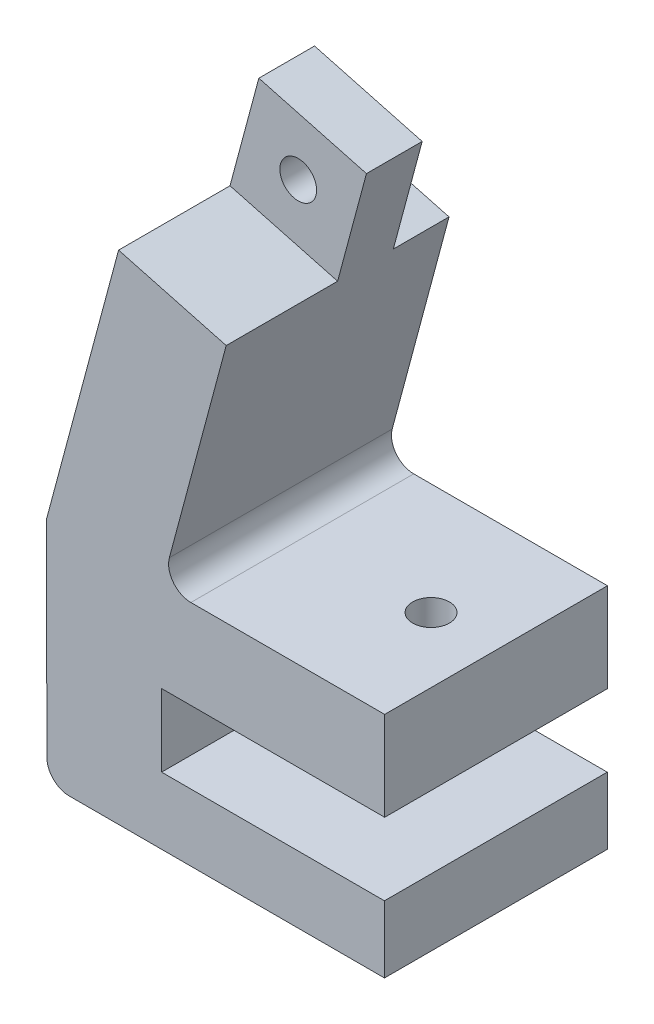
ISO-10303-21;
HEADER;
FILE_DESCRIPTION(('STEP AP214'),'2;1');
FILE_NAME('part.step','',(''),(''),'','','');
FILE_SCHEMA(('AUTOMOTIVE_DESIGN { 1 0 10303 214 1 1 1 1 }'));
ENDSEC;
DATA;
#1=APPLICATION_CONTEXT('core data for automotive mechanical design processes');
#2=APPLICATION_PROTOCOL_DEFINITION('international standard','automotive_design',2000,#1);
#3=PRODUCT_CONTEXT('',#1,'mechanical');
#4=PRODUCT('Part','Part','',(#3));
#5=PRODUCT_RELATED_PRODUCT_CATEGORY('part','',(#4));
#6=PRODUCT_DEFINITION_FORMATION('','',#4);
#7=PRODUCT_DEFINITION_CONTEXT('part definition',#1,'design');
#8=PRODUCT_DEFINITION('design','',#6,#7);
#9=PRODUCT_DEFINITION_SHAPE('','',#8);
#10=(LENGTH_UNIT() NAMED_UNIT(*) SI_UNIT(.MILLI.,.METRE.));
#11=(NAMED_UNIT(*) PLANE_ANGLE_UNIT() SI_UNIT($,.RADIAN.));
#12=(NAMED_UNIT(*) SI_UNIT($,.STERADIAN.) SOLID_ANGLE_UNIT());
#13=UNCERTAINTY_MEASURE_WITH_UNIT(LENGTH_MEASURE(1.E-05),#10,'distance_accuracy_value','');
#14=(GEOMETRIC_REPRESENTATION_CONTEXT(3) GLOBAL_UNCERTAINTY_ASSIGNED_CONTEXT((#13)) GLOBAL_UNIT_ASSIGNED_CONTEXT((#10,
#11,#12)) REPRESENTATION_CONTEXT('',''));
#15=CARTESIAN_POINT('',(0.,0.,0.));
#16=DIRECTION('',(0.,0.,1.));
#17=DIRECTION('',(1.,0.,0.));
#18=AXIS2_PLACEMENT_3D('',#15,#16,#17);
#19=CARTESIAN_POINT('',(-21.2564973158032,54.2550368740267,20.));
#20=DIRECTION('',(-0.258819045102511,-0.965925826289071,0.));
#21=DIRECTION('',(0.965925826289071,-0.258819045102511,0.));
#22=AXIS2_PLACEMENT_3D('',#19,#20,#21);
#23=PLANE('',#22);
#24=DIRECTION('',(0.,0.,-1.));
#25=VECTOR('',#24,1.);
#26=CARTESIAN_POINT('',(-11.597239052912,51.6668464230015,20.));
#27=LINE('',#26,#25);
#28=CARTESIAN_POINT('',(-11.597239052912,51.6668464230015,10.));
#29=VERTEX_POINT('',#28);
#30=CARTESIAN_POINT('',(-11.597239052912,51.6668464230015,5.));
#31=VERTEX_POINT('',#30);
#32=EDGE_CURVE('E179',#29,#31,#27,.T.);
#33=ORIENTED_EDGE('',*,*,#32,.T.);
#34=DIRECTION('',(0.965925826289067,-0.258819045102526,0.));
#35=VECTOR('',#34,1.);
#36=CARTESIAN_POINT('',(-22.2224231420917,54.5138559191292,5.));
#37=LINE('',#36,#35);
#38=CARTESIAN_POINT('',(-21.2564973158032,54.2550368740269,5.));
#39=VERTEX_POINT('',#38);
#40=EDGE_CURVE('E160',#39,#31,#37,.T.);
#41=ORIENTED_EDGE('',*,*,#40,.F.);
#42=DIRECTION('',(0.,0.,-1.));
#43=VECTOR('',#42,1.);
#44=CARTESIAN_POINT('',(-21.2564973158032,54.2550368740267,20.));
#45=LINE('',#44,#43);
#46=CARTESIAN_POINT('',(-21.2564973158032,54.2550368740267,10.));
#47=VERTEX_POINT('',#46);
#48=EDGE_CURVE('E186',#47,#39,#45,.T.);
#49=ORIENTED_EDGE('',*,*,#48,.F.);
#50=DIRECTION('',(-0.965925826289071,0.258819045102511,0.));
#51=VECTOR('',#50,1.);
#52=CARTESIAN_POINT('',(-21.2564973158032,54.2550368740267,10.));
#53=LINE('',#52,#51);
#54=EDGE_CURVE('E183',#29,#47,#53,.T.);
#55=ORIENTED_EDGE('',*,*,#54,.F.);
#56=EDGE_LOOP('',(#33,#41,#49,#55));
#57=FACE_BOUND('',#56,.T.);
#58=ADVANCED_FACE('F39',(#57),#23,.F.);
#59=CARTESIAN_POINT('',(-5.79861952645607,12.4476329539094,10.));
#60=DIRECTION('',(0.,-1.,0.));
#61=DIRECTION('',(0.,0.,-1.));
#62=AXIS2_PLACEMENT_3D('',#59,#60,#61);
#63=CYLINDRICAL_SURFACE('',#62,1.65);
#64=CARTESIAN_POINT('',(-5.79861952645607,20.4476329539094,10.));
#65=DIRECTION('',(0.,-1.,0.));
#66=DIRECTION('',(1.,0.,0.));
#67=AXIS2_PLACEMENT_3D('',#64,#65,#66);
#68=CIRCLE('',#67,1.65);
#69=CARTESIAN_POINT('',(-4.14861952645607,20.4476329539095,10.));
#70=VERTEX_POINT('',#69);
#71=EDGE_CURVE('E240',#70,#70,#68,.T.);
#72=ORIENTED_EDGE('',*,*,#71,.F.);
#73=EDGE_LOOP('',(#72));
#74=FACE_BOUND('',#73,.T.);
#75=CARTESIAN_POINT('',(-5.79861952645607,16.4476329539094,10.));
#76=DIRECTION('',(0.,-1.,0.));
#77=DIRECTION('',(1.,0.,0.));
#78=AXIS2_PLACEMENT_3D('',#75,#76,#77);
#79=CIRCLE('',#78,1.65);
#80=CARTESIAN_POINT('',(-4.14861952645607,16.4476329539095,10.));
#81=VERTEX_POINT('',#80);
#82=EDGE_CURVE('E237',#81,#81,#79,.F.);
#83=ORIENTED_EDGE('',*,*,#82,.F.);
#84=EDGE_LOOP('',(#83));
#85=FACE_BOUND('',#84,.T.);
#86=ADVANCED_FACE('F447',(#74,#85),#63,.F.);
#87=CARTESIAN_POINT('',(-20.0000684269883,12.4476329539093,20.));
#88=DIRECTION('',(0.,1.,0.));
#89=DIRECTION('',(-1.,0.,0.));
#90=AXIS2_PLACEMENT_3D('',#87,#88,#89);
#91=PLANE('',#90);
#92=CARTESIAN_POINT('',(-5.79861952645607,12.4476329539094,10.));
#93=DIRECTION('',(0.,-1.,0.));
#94=DIRECTION('',(1.,0.,0.));
#95=AXIS2_PLACEMENT_3D('',#92,#93,#94);
#96=CIRCLE('',#95,3.5);
#97=CARTESIAN_POINT('',(-2.29861952645607,12.4476329539095,10.));
#98=VERTEX_POINT('',#97);
#99=EDGE_CURVE('E250',#98,#98,#96,.T.);
#100=ORIENTED_EDGE('',*,*,#99,.F.);
#101=EDGE_LOOP('',(#100));
#102=FACE_BOUND('',#101,.T.);
#103=DIRECTION('',(1.,0.,0.));
#104=VECTOR('',#103,1.);
#105=CARTESIAN_POINT('',(-20.0000684269883,12.4476329539093,0.));
#106=LINE('',#105,#104);
#107=CARTESIAN_POINT('',(-20.0000684269883,12.4476329539093,0.));
#108=VERTEX_POINT('',#107);
#109=CARTESIAN_POINT('',(0.0375979097115367,12.4476329539095,0.));
#110=VERTEX_POINT('',#109);
#111=EDGE_CURVE('E306',#108,#110,#106,.T.);
#112=ORIENTED_EDGE('',*,*,#111,.T.);
#113=DIRECTION('',(0.,0.,-1.));
#114=VECTOR('',#113,1.);
#115=CARTESIAN_POINT('',(0.0375979097115367,12.4476329539095,20.));
#116=LINE('',#115,#114);
#117=CARTESIAN_POINT('',(0.0375979097115367,12.4476329539095,20.));
#118=VERTEX_POINT('',#117);
#119=EDGE_CURVE('E191',#118,#110,#116,.T.);
#120=ORIENTED_EDGE('',*,*,#119,.F.);
#121=DIRECTION('',(1.,0.,0.));
#122=VECTOR('',#121,1.);
#123=CARTESIAN_POINT('',(-20.0000684269883,12.4476329539093,20.));
#124=LINE('',#123,#122);
#125=CARTESIAN_POINT('',(-20.0000684269883,12.4476329539093,20.));
#126=VERTEX_POINT('',#125);
#127=EDGE_CURVE('E274',#126,#118,#124,.T.);
#128=ORIENTED_EDGE('',*,*,#127,.F.);
#129=DIRECTION('',(0.,0.,-1.));
#130=VECTOR('',#129,1.);
#131=CARTESIAN_POINT('',(-20.0000684269883,12.4476329539093,20.));
#132=LINE('',#131,#130);
#133=EDGE_CURVE('E200',#126,#108,#132,.T.);
#134=ORIENTED_EDGE('',*,*,#133,.T.);
#135=EDGE_LOOP('',(#112,#120,#128,#134));
#136=FACE_BOUND('',#135,.T.);
#137=ADVANCED_FACE('F366',(#102,#136),#91,.F.);
#138=CARTESIAN_POINT('',(-30.2796638365886,-0.0523661789465783,20.));
#139=DIRECTION('',(0.,1.,0.));
#140=DIRECTION('',(-1.,0.,0.));
#141=AXIS2_PLACEMENT_3D('',#138,#139,#140);
#142=PLANE('',#141);
#143=DIRECTION('',(1.,0.,0.));
#144=VECTOR('',#143,1.);
#145=CARTESIAN_POINT('',(-30.2796638365886,-0.0523661789465783,20.));
#146=LINE('',#145,#144);
#147=CARTESIAN_POINT('',(-28.2831242581905,-0.0523661789465507,20.));
#148=VERTEX_POINT('',#147);
#149=CARTESIAN_POINT('',(0.0201441864600046,-0.0523661789461585,20.));
#150=VERTEX_POINT('',#149);
#151=EDGE_CURVE('E261',#148,#150,#146,.T.);
#152=ORIENTED_EDGE('',*,*,#151,.F.);
#153=DIRECTION('',(0.,0.,-1.));
#154=VECTOR('',#153,1.);
#155=CARTESIAN_POINT('',(-28.2831242581905,-0.0523661789465507,20.));
#156=LINE('',#155,#154);
#157=CARTESIAN_POINT('',(-28.2831242581905,-0.0523661789465507,0.));
#158=VERTEX_POINT('',#157);
#159=EDGE_CURVE('E229',#148,#158,#156,.T.);
#160=ORIENTED_EDGE('',*,*,#159,.T.);
#161=DIRECTION('',(1.,0.,0.));
#162=VECTOR('',#161,1.);
#163=CARTESIAN_POINT('',(-30.2796638365886,-0.0523661789465783,0.));
#164=LINE('',#163,#162);
#165=CARTESIAN_POINT('',(0.0201441864600046,-0.0523661789461585,0.));
#166=VERTEX_POINT('',#165);
#167=EDGE_CURVE('E247',#158,#166,#164,.T.);
#168=ORIENTED_EDGE('',*,*,#167,.T.);
#169=DIRECTION('',(0.,0.,-1.));
#170=VECTOR('',#169,1.);
#171=CARTESIAN_POINT('',(0.0201441864600046,-0.0523661789461585,20.));
#172=LINE('',#171,#170);
#173=EDGE_CURVE('E212',#150,#166,#172,.T.);
#174=ORIENTED_EDGE('',*,*,#173,.F.);
#175=EDGE_LOOP('',(#152,#160,#168,#174));
#176=FACE_BOUND('',#175,.T.);
#177=ADVANCED_FACE('F344',(#176),#142,.F.);
#178=CARTESIAN_POINT('',(0.0201441864600046,-0.0523661789461585,20.));
#179=DIRECTION('',(-0.999999855475947,-0.000537631923378172,0.));
#180=DIRECTION('',(0.000537631923378172,-0.999999855475947,0.));
#181=AXIS2_PLACEMENT_3D('',#178,#179,#180);
#182=PLANE('',#181);
#183=DIRECTION('',(-0.000537631923378172,0.999999855475947,0.));
#184=VECTOR('',#183,1.);
#185=CARTESIAN_POINT('',(0.0201441864600046,-0.0523661789461585,0.));
#186=LINE('',#185,#184);
#187=CARTESIAN_POINT('',(0.0169183949197356,5.94763295390952,0.));
#188=VERTEX_POINT('',#187);
#189=EDGE_CURVE('E297',#166,#188,#186,.T.);
#190=ORIENTED_EDGE('',*,*,#189,.T.);
#191=DIRECTION('',(0.,0.,-1.));
#192=VECTOR('',#191,1.);
#193=CARTESIAN_POINT('',(0.0169183949197356,5.94763295390952,20.));
#194=LINE('',#193,#192);
#195=CARTESIAN_POINT('',(0.0169183949197356,5.94763295390952,20.));
#196=VERTEX_POINT('',#195);
#197=EDGE_CURVE('E208',#196,#188,#194,.T.);
#198=ORIENTED_EDGE('',*,*,#197,.F.);
#199=DIRECTION('',(-0.000537631923378172,0.999999855475947,0.));
#200=VECTOR('',#199,1.);
#201=CARTESIAN_POINT('',(0.0201441864600046,-0.0523661789461585,20.));
#202=LINE('',#201,#200);
#203=EDGE_CURVE('E264',#150,#196,#202,.T.);
#204=ORIENTED_EDGE('',*,*,#203,.F.);
#205=ORIENTED_EDGE('',*,*,#173,.T.);
#206=EDGE_LOOP('',(#190,#198,#204,#205));
#207=FACE_BOUND('',#206,.T.);
#208=ADVANCED_FACE('F351',(#207),#182,.F.);
#209=CARTESIAN_POINT('',(0.0169183949197356,5.94763295390952,20.));
#210=DIRECTION('',(0.,-1.,0.));
#211=DIRECTION('',(1.,0.,0.));
#212=AXIS2_PLACEMENT_3D('',#209,#210,#211);
#213=PLANE('',#212);
#214=DIRECTION('',(-1.,0.,0.));
#215=VECTOR('',#214,1.);
#216=CARTESIAN_POINT('',(0.0169183949197356,5.94763295390952,0.));
#217=LINE('',#216,#215);
#218=CARTESIAN_POINT('',(-19.9830816050803,5.94763295390925,0.));
#219=VERTEX_POINT('',#218);
#220=EDGE_CURVE('E300',#188,#219,#217,.T.);
#221=ORIENTED_EDGE('',*,*,#220,.T.);
#222=DIRECTION('',(0.,0.,-1.));
#223=VECTOR('',#222,1.);
#224=CARTESIAN_POINT('',(-19.9830816050803,5.94763295390925,20.));
#225=LINE('',#224,#223);
#226=CARTESIAN_POINT('',(-19.9830816050803,5.94763295390925,20.));
#227=VERTEX_POINT('',#226);
#228=EDGE_CURVE('E204',#227,#219,#225,.T.);
#229=ORIENTED_EDGE('',*,*,#228,.F.);
#230=DIRECTION('',(-1.,0.,0.));
#231=VECTOR('',#230,1.);
#232=CARTESIAN_POINT('',(0.0169183949197356,5.94763295390952,20.));
#233=LINE('',#232,#231);
#234=EDGE_CURVE('E268',#196,#227,#233,.T.);
#235=ORIENTED_EDGE('',*,*,#234,.F.);
#236=ORIENTED_EDGE('',*,*,#197,.T.);
#237=EDGE_LOOP('',(#221,#229,#235,#236));
#238=FACE_BOUND('',#237,.T.);
#239=ADVANCED_FACE('F356',(#238),#213,.F.);
#240=CARTESIAN_POINT('',(-19.9830816050803,5.94763295390925,20.));
#241=DIRECTION('',(-0.999996585199521,-0.00261334829253206,0.));
#242=DIRECTION('',(0.00261334829253206,-0.999996585199521,0.));
#243=AXIS2_PLACEMENT_3D('',#240,#241,#242);
#244=PLANE('',#243);
#245=DIRECTION('',(-0.00261334829253206,0.99999658519952,0.));
#246=VECTOR('',#245,1.);
#247=CARTESIAN_POINT('',(-19.9830816050803,5.94763295390925,0.));
#248=LINE('',#247,#246);
#249=EDGE_CURVE('E303',#219,#108,#248,.T.);
#250=ORIENTED_EDGE('',*,*,#249,.T.);
#251=ORIENTED_EDGE('',*,*,#133,.F.);
#252=DIRECTION('',(-0.00261334829253206,0.99999658519952,0.));
#253=VECTOR('',#252,1.);
#254=CARTESIAN_POINT('',(-19.9830816050803,5.94763295390925,20.));
#255=LINE('',#254,#253);
#256=EDGE_CURVE('E271',#227,#126,#255,.T.);
#257=ORIENTED_EDGE('',*,*,#256,.F.);
#258=ORIENTED_EDGE('',*,*,#228,.T.);
#259=EDGE_LOOP('',(#250,#251,#257,#258));
#260=FACE_BOUND('',#259,.T.);
#261=ADVANCED_FACE('F362',(#260),#244,.F.);
#262=CARTESIAN_POINT('',(0.0375979097115367,12.4476329539095,20.));
#263=DIRECTION('',(-1.,-1.6190695973587E-13,0.));
#264=DIRECTION('',(1.6190695973587E-13,-1.,0.));
#265=AXIS2_PLACEMENT_3D('',#262,#263,#264);
#266=PLANE('',#265);
#267=DIRECTION('',(-1.6190695973587E-13,1.,0.));
#268=VECTOR('',#267,1.);
#269=CARTESIAN_POINT('',(0.0375979097115367,12.4476329539095,0.));
#270=LINE('',#269,#268);
#271=CARTESIAN_POINT('',(0.0375979097102415,20.4476329539095,0.));
#272=VERTEX_POINT('',#271);
#273=EDGE_CURVE('E309',#110,#272,#270,.T.);
#274=ORIENTED_EDGE('',*,*,#273,.T.);
#275=DIRECTION('',(0.,0.,-1.));
#276=VECTOR('',#275,1.);
#277=CARTESIAN_POINT('',(0.0375979097102415,20.4476329539095,20.));
#278=LINE('',#277,#276);
#279=CARTESIAN_POINT('',(0.0375979097102415,20.4476329539095,20.));
#280=VERTEX_POINT('',#279);
#281=EDGE_CURVE('E185',#280,#272,#278,.T.);
#282=ORIENTED_EDGE('',*,*,#281,.F.);
#283=DIRECTION('',(-1.6190695973587E-13,1.,0.));
#284=VECTOR('',#283,1.);
#285=CARTESIAN_POINT('',(0.0375979097115367,12.4476329539095,20.));
#286=LINE('',#285,#284);
#287=EDGE_CURVE('E277',#118,#280,#286,.T.);
#288=ORIENTED_EDGE('',*,*,#287,.F.);
#289=ORIENTED_EDGE('',*,*,#119,.T.);
#290=EDGE_LOOP('',(#274,#282,#288,#289));
#291=FACE_BOUND('',#290,.T.);
#292=ADVANCED_FACE('F371',(#291),#266,.F.);
#293=CARTESIAN_POINT('',(0.0375979097102415,20.4476329539095,20.));
#294=DIRECTION('',(0.,-1.,0.));
#295=DIRECTION('',(1.,0.,0.));
#296=AXIS2_PLACEMENT_3D('',#293,#294,#295);
#297=PLANE('',#296);
#298=ORIENTED_EDGE('',*,*,#71,.T.);
#299=EDGE_LOOP('',(#298));
#300=FACE_BOUND('',#299,.T.);
#301=DIRECTION('',(-1.,0.,0.));
#302=VECTOR('',#301,1.);
#303=CARTESIAN_POINT('',(0.0375979097102415,20.4476329539095,0.));
#304=LINE('',#303,#302);
#305=CARTESIAN_POINT('',(-17.3559513446078,20.4476329539093,0.));
#306=VERTEX_POINT('',#305);
#307=EDGE_CURVE('E312',#272,#306,#304,.T.);
#308=ORIENTED_EDGE('',*,*,#307,.T.);
#309=DIRECTION('',(0.,0.,-1.));
#310=VECTOR('',#309,1.);
#311=CARTESIAN_POINT('',(-17.3559513446078,20.4476329539093,20.));
#312=LINE('',#311,#310);
#313=CARTESIAN_POINT('',(-17.3559513446078,20.4476329539093,20.));
#314=VERTEX_POINT('',#313);
#315=EDGE_CURVE('E220',#306,#314,#312,.F.);
#316=ORIENTED_EDGE('',*,*,#315,.T.);
#317=DIRECTION('',(-1.,0.,0.));
#318=VECTOR('',#317,1.);
#319=CARTESIAN_POINT('',(0.0375979097102415,20.4476329539095,20.));
#320=LINE('',#319,#318);
#321=EDGE_CURVE('E280',#280,#314,#320,.T.);
#322=ORIENTED_EDGE('',*,*,#321,.F.);
#323=ORIENTED_EDGE('',*,*,#281,.T.);
#324=EDGE_LOOP('',(#308,#316,#322,#323));
#325=FACE_BOUND('',#324,.T.);
#326=ADVANCED_FACE('F459',(#300,#325),#297,.F.);
#327=CARTESIAN_POINT('',(-19.9624020902902,20.4476329539093,20.));
#328=DIRECTION('',(-0.965925826289067,0.258819045102526,0.));
#329=DIRECTION('',(-0.258819045102526,-0.965925826289067,0.));
#330=AXIS2_PLACEMENT_3D('',#327,#328,#329);
#331=PLANE('',#330);
#332=DIRECTION('',(0.258819045102526,0.965925826289067,0.));
#333=VECTOR('',#332,1.);
#334=CARTESIAN_POINT('',(-19.9624020902902,20.4476329539093,0.));
#335=LINE('',#334,#333);
#336=CARTESIAN_POINT('',(-19.2878029971859,22.9652710441143,0.));
#337=VERTEX_POINT('',#336);
#338=CARTESIAN_POINT('',(-14.1854295039372,42.0075881601108,0.));
#339=VERTEX_POINT('',#338);
#340=EDGE_CURVE('E316',#337,#339,#335,.T.);
#341=ORIENTED_EDGE('',*,*,#340,.T.);
#342=DIRECTION('',(0.,0.,-1.));
#343=VECTOR('',#342,1.);
#344=CARTESIAN_POINT('',(-14.1854295039372,42.0075881601108,0.));
#345=LINE('',#344,#343);
#346=CARTESIAN_POINT('',(-14.1854295039372,42.0075881601108,5.));
#347=VERTEX_POINT('',#346);
#348=EDGE_CURVE('E57',#347,#339,#345,.T.);
#349=ORIENTED_EDGE('',*,*,#348,.F.);
#350=DIRECTION('',(-0.258819045102526,-0.965925826289067,0.));
#351=VECTOR('',#350,1.);
#352=CARTESIAN_POINT('',(-11.597239052912,51.6668464230015,5.));
#353=LINE('',#352,#351);
#354=EDGE_CURVE('E164',#31,#347,#353,.T.);
#355=ORIENTED_EDGE('',*,*,#354,.F.);
#356=ORIENTED_EDGE('',*,*,#32,.F.);
#357=DIRECTION('',(0.258819045102511,0.965925826289071,0.));
#358=VECTOR('',#357,1.);
#359=CARTESIAN_POINT('',(-11.597239052912,51.6668464230015,10.));
#360=LINE('',#359,#358);
#361=CARTESIAN_POINT('',(-14.1854295039371,42.0075881601108,10.));
#362=VERTEX_POINT('',#361);
#363=EDGE_CURVE('E419',#362,#29,#360,.T.);
#364=ORIENTED_EDGE('',*,*,#363,.F.);
#365=DIRECTION('',(0.,0.,1.));
#366=VECTOR('',#365,1.);
#367=CARTESIAN_POINT('',(-14.1854295039371,42.0075881601108,10.));
#368=LINE('',#367,#366);
#369=CARTESIAN_POINT('',(-14.1854295039371,42.0075881601108,20.));
#370=VERTEX_POINT('',#369);
#371=EDGE_CURVE('E256',#362,#370,#368,.T.);
#372=ORIENTED_EDGE('',*,*,#371,.T.);
#373=DIRECTION('',(0.258819045102526,0.965925826289067,0.));
#374=VECTOR('',#373,1.);
#375=CARTESIAN_POINT('',(-19.9624020902902,20.4476329539093,20.));
#376=LINE('',#375,#374);
#377=CARTESIAN_POINT('',(-19.2878029971859,22.9652710441143,20.));
#378=VERTEX_POINT('',#377);
#379=EDGE_CURVE('E284',#378,#370,#376,.T.);
#380=ORIENTED_EDGE('',*,*,#379,.F.);
#381=DIRECTION('',(0.,0.,-1.));
#382=VECTOR('',#381,1.);
#383=CARTESIAN_POINT('',(-19.2878029971859,22.9652710441143,0.));
#384=LINE('',#383,#382);
#385=EDGE_CURVE('E216',#378,#337,#384,.T.);
#386=ORIENTED_EDGE('',*,*,#385,.T.);
#387=EDGE_LOOP('',(#341,#349,#355,#356,#364,#372,#380,#386));
#388=FACE_BOUND('',#387,.T.);
#389=ADVANCED_FACE('F177',(#388),#331,.F.);
#390=CARTESIAN_POINT('',(-21.2564973158032,54.2550368740267,20.));
#391=DIRECTION('',(0.965925826289071,-0.258819045102512,0.));
#392=DIRECTION('',(0.258819045102512,0.965925826289071,0.));
#393=AXIS2_PLACEMENT_3D('',#390,#391,#392);
#394=PLANE('',#393);
#395=DIRECTION('',(-0.258819045102512,-0.965925826289071,0.));
#396=VECTOR('',#395,1.);
#397=CARTESIAN_POINT('',(-21.2564973158032,54.2550368740267,5.));
#398=LINE('',#397,#396);
#399=CARTESIAN_POINT('',(-23.8446877668283,44.5957786111362,5.));
#400=VERTEX_POINT('',#399);
#401=EDGE_CURVE('E166',#39,#400,#398,.T.);
#402=ORIENTED_EDGE('',*,*,#401,.T.);
#403=DIRECTION('',(0.,0.,-1.));
#404=VECTOR('',#403,1.);
#405=CARTESIAN_POINT('',(-23.8446877668283,44.5957786111362,20.));
#406=LINE('',#405,#404);
#407=CARTESIAN_POINT('',(-23.8446877668283,44.5957786111362,0.));
#408=VERTEX_POINT('',#407);
#409=EDGE_CURVE('E395',#400,#408,#406,.T.);
#410=ORIENTED_EDGE('',*,*,#409,.T.);
#411=DIRECTION('',(-0.258819045102512,-0.965925826289071,0.));
#412=VECTOR('',#411,1.);
#413=CARTESIAN_POINT('',(-21.2564973158032,54.2550368740267,0.));
#414=LINE('',#413,#412);
#415=CARTESIAN_POINT('',(-30.3151638943911,20.4476329539092,0.));
#416=VERTEX_POINT('',#415);
#417=EDGE_CURVE('E319',#408,#416,#414,.T.);
#418=ORIENTED_EDGE('',*,*,#417,.T.);
#419=DIRECTION('',(0.,0.,-1.));
#420=VECTOR('',#419,1.);
#421=CARTESIAN_POINT('',(-30.3151638943911,20.4476329539092,20.));
#422=LINE('',#421,#420);
#423=CARTESIAN_POINT('',(-30.3151638943911,20.4476329539092,20.));
#424=VERTEX_POINT('',#423);
#425=EDGE_CURVE('E193',#424,#416,#422,.T.);
#426=ORIENTED_EDGE('',*,*,#425,.F.);
#427=DIRECTION('',(-0.258819045102512,-0.965925826289071,0.));
#428=VECTOR('',#427,1.);
#429=CARTESIAN_POINT('',(-21.2564973158032,54.2550368740267,20.));
#430=LINE('',#429,#428);
#431=CARTESIAN_POINT('',(-23.8446877668283,44.595778611136,20.));
#432=VERTEX_POINT('',#431);
#433=EDGE_CURVE('E288',#432,#424,#430,.T.);
#434=ORIENTED_EDGE('',*,*,#433,.F.);
#435=DIRECTION('',(0.,0.,1.));
#436=VECTOR('',#435,1.);
#437=CARTESIAN_POINT('',(-23.8446877668283,44.595778611136,10.));
#438=LINE('',#437,#436);
#439=CARTESIAN_POINT('',(-23.8446877668283,44.595778611136,10.));
#440=VERTEX_POINT('',#439);
#441=EDGE_CURVE('E65',#440,#432,#438,.T.);
#442=ORIENTED_EDGE('',*,*,#441,.F.);
#443=DIRECTION('',(-0.258819045102511,-0.965925826289071,0.));
#444=VECTOR('',#443,1.);
#445=CARTESIAN_POINT('',(-21.2564973158032,54.2550368740267,10.));
#446=LINE('',#445,#444);
#447=EDGE_CURVE('E411',#47,#440,#446,.T.);
#448=ORIENTED_EDGE('',*,*,#447,.F.);
#449=ORIENTED_EDGE('',*,*,#48,.T.);
#450=EDGE_LOOP('',(#402,#410,#418,#426,#434,#442,#448,#449));
#451=FACE_BOUND('',#450,.T.);
#452=ADVANCED_FACE('F427',(#451),#394,.F.);
#453=CARTESIAN_POINT('',(-30.3151638943911,20.4476329539092,20.));
#454=DIRECTION('',(0.999998500593247,0.00173170761342305,0.));
#455=DIRECTION('',(-0.00173170761342305,0.999998500593247,0.));
#456=AXIS2_PLACEMENT_3D('',#453,#454,#455);
#457=PLANE('',#456);
#458=DIRECTION('',(0.00173170761342305,-0.999998500593247,0.));
#459=VECTOR('',#458,1.);
#460=CARTESIAN_POINT('',(-30.3151638943911,20.4476329539092,0.));
#461=LINE('',#460,#459);
#462=CARTESIAN_POINT('',(-30.283121259377,1.9441704058266,0.));
#463=VERTEX_POINT('',#462);
#464=EDGE_CURVE('E265',#416,#463,#461,.T.);
#465=ORIENTED_EDGE('',*,*,#464,.T.);
#466=DIRECTION('',(0.,0.,-1.));
#467=VECTOR('',#466,1.);
#468=CARTESIAN_POINT('',(-30.283121259377,1.9441704058266,20.));
#469=LINE('',#468,#467);
#470=CARTESIAN_POINT('',(-30.283121259377,1.9441704058266,20.));
#471=VERTEX_POINT('',#470);
#472=EDGE_CURVE('E49',#463,#471,#469,.F.);
#473=ORIENTED_EDGE('',*,*,#472,.T.);
#474=DIRECTION('',(0.00173170761342305,-0.999998500593247,0.));
#475=VECTOR('',#474,1.);
#476=CARTESIAN_POINT('',(-30.3151638943911,20.4476329539092,20.));
#477=LINE('',#476,#475);
#478=EDGE_CURVE('E291',#424,#471,#477,.T.);
#479=ORIENTED_EDGE('',*,*,#478,.F.);
#480=ORIENTED_EDGE('',*,*,#425,.T.);
#481=EDGE_LOOP('',(#465,#473,#479,#480));
#482=FACE_BOUND('',#481,.T.);
#483=ADVANCED_FACE('F330',(#482),#457,.F.);
#484=CARTESIAN_POINT('',(0.,0.,20.));
#485=DIRECTION('',(0.,0.,1.));
#486=DIRECTION('',(1.,0.,0.));
#487=AXIS2_PLACEMENT_3D('',#484,#485,#486);
#488=PLANE('',#487);
#489=DIRECTION('',(0.965925826289071,-0.258819045102511,0.));
#490=VECTOR('',#489,1.);
#491=CARTESIAN_POINT('',(-23.8446877668283,44.595778611136,20.));
#492=LINE('',#491,#490);
#493=EDGE_CURVE('E410',#432,#370,#492,.T.);
#494=ORIENTED_EDGE('',*,*,#493,.F.);
#495=ORIENTED_EDGE('',*,*,#433,.T.);
#496=ORIENTED_EDGE('',*,*,#478,.T.);
#497=CARTESIAN_POINT('',(-28.2831242581905,1.94763382105345,20.));
#498=DIRECTION('',(0.,0.,1.));
#499=DIRECTION('',(1.,0.,0.));
#500=AXIS2_PLACEMENT_3D('',#497,#498,#499);
#501=CIRCLE('',#500,2.);
#502=EDGE_CURVE('E11',#471,#148,#501,.T.);
#503=ORIENTED_EDGE('',*,*,#502,.T.);
#504=ORIENTED_EDGE('',*,*,#151,.T.);
#505=ORIENTED_EDGE('',*,*,#203,.T.);
#506=ORIENTED_EDGE('',*,*,#234,.T.);
#507=ORIENTED_EDGE('',*,*,#256,.T.);
#508=ORIENTED_EDGE('',*,*,#127,.T.);
#509=ORIENTED_EDGE('',*,*,#287,.T.);
#510=ORIENTED_EDGE('',*,*,#321,.T.);
#511=CARTESIAN_POINT('',(-17.3559513446078,22.4476329539093,20.));
#512=DIRECTION('',(0.,0.,1.));
#513=DIRECTION('',(1.,0.,0.));
#514=AXIS2_PLACEMENT_3D('',#511,#512,#513);
#515=CIRCLE('',#514,2.);
#516=EDGE_CURVE('E226',#314,#378,#515,.F.);
#517=ORIENTED_EDGE('',*,*,#516,.T.);
#518=ORIENTED_EDGE('',*,*,#379,.T.);
#519=EDGE_LOOP('',(#494,#495,#496,#503,#504,#505,#506,#507,#508,#509,#510,#517,#518));
#520=FACE_BOUND('',#519,.T.);
#521=ADVANCED_FACE('F348',(#520),#488,.T.);
#522=CARTESIAN_POINT('',(0.,0.,0.));
#523=DIRECTION('',(0.,0.,1.));
#524=DIRECTION('',(1.,0.,0.));
#525=AXIS2_PLACEMENT_3D('',#522,#523,#524);
#526=PLANE('',#525);
#527=ORIENTED_EDGE('',*,*,#417,.F.);
#528=DIRECTION('',(0.965925826289067,-0.258819045102526,0.));
#529=VECTOR('',#528,1.);
#530=CARTESIAN_POINT('',(-24.810613593117,44.8545976562386,0.));
#531=LINE('',#530,#529);
#532=EDGE_CURVE('E383',#408,#339,#531,.T.);
#533=ORIENTED_EDGE('',*,*,#532,.T.);
#534=ORIENTED_EDGE('',*,*,#340,.F.);
#535=CARTESIAN_POINT('',(-17.3559513446078,22.4476329539093,0.));
#536=DIRECTION('',(0.,0.,1.));
#537=DIRECTION('',(1.,0.,0.));
#538=AXIS2_PLACEMENT_3D('',#535,#536,#537);
#539=CIRCLE('',#538,2.);
#540=EDGE_CURVE('E223',#337,#306,#539,.T.);
#541=ORIENTED_EDGE('',*,*,#540,.T.);
#542=ORIENTED_EDGE('',*,*,#307,.F.);
#543=ORIENTED_EDGE('',*,*,#273,.F.);
#544=ORIENTED_EDGE('',*,*,#111,.F.);
#545=ORIENTED_EDGE('',*,*,#249,.F.);
#546=ORIENTED_EDGE('',*,*,#220,.F.);
#547=ORIENTED_EDGE('',*,*,#189,.F.);
#548=ORIENTED_EDGE('',*,*,#167,.F.);
#549=CARTESIAN_POINT('',(-28.2831242581905,1.94763382105345,0.));
#550=DIRECTION('',(0.,0.,1.));
#551=DIRECTION('',(1.,0.,0.));
#552=AXIS2_PLACEMENT_3D('',#549,#550,#551);
#553=CIRCLE('',#552,2.);
#554=EDGE_CURVE('E233',#158,#463,#553,.F.);
#555=ORIENTED_EDGE('',*,*,#554,.T.);
#556=ORIENTED_EDGE('',*,*,#464,.F.);
#557=EDGE_LOOP('',(#527,#533,#534,#541,#542,#543,#544,#545,#546,#547,#548,#555,#556));
#558=FACE_BOUND('',#557,.T.);
#559=ADVANCED_FACE('F336',(#558),#526,.F.);
#560=CARTESIAN_POINT('',(-17.3559513446078,22.4476329539093,20.));
#561=DIRECTION('',(0.,0.,1.));
#562=DIRECTION('',(1.,0.,0.));
#563=AXIS2_PLACEMENT_3D('',#560,#561,#562);
#564=CYLINDRICAL_SURFACE('',#563,2.);
#565=ORIENTED_EDGE('',*,*,#516,.F.);
#566=ORIENTED_EDGE('',*,*,#315,.F.);
#567=ORIENTED_EDGE('',*,*,#540,.F.);
#568=ORIENTED_EDGE('',*,*,#385,.F.);
#569=EDGE_LOOP('',(#565,#566,#567,#568));
#570=FACE_BOUND('',#569,.T.);
#571=ADVANCED_FACE('F379',(#570),#564,.F.);
#572=CARTESIAN_POINT('',(-28.2831242581905,1.94763382105345,20.));
#573=DIRECTION('',(0.,0.,-1.));
#574=DIRECTION('',(-1.,0.,0.));
#575=AXIS2_PLACEMENT_3D('',#572,#573,#574);
#576=CYLINDRICAL_SURFACE('',#575,2.);
#577=ORIENTED_EDGE('',*,*,#502,.F.);
#578=ORIENTED_EDGE('',*,*,#472,.F.);
#579=ORIENTED_EDGE('',*,*,#554,.F.);
#580=ORIENTED_EDGE('',*,*,#159,.F.);
#581=EDGE_LOOP('',(#577,#578,#579,#580));
#582=FACE_BOUND('',#581,.T.);
#583=ADVANCED_FACE('F41',(#582),#576,.T.);
#584=CARTESIAN_POINT('',(-5.79861952645612,16.4476329539094,10.));
#585=DIRECTION('',(0.,-1.,0.));
#586=DIRECTION('',(1.,0.,0.));
#587=AXIS2_PLACEMENT_3D('',#584,#585,#586);
#588=PLANE('',#587);
#589=CARTESIAN_POINT('',(-5.79861952645612,16.4476329539094,10.));
#590=DIRECTION('',(0.,-1.,0.));
#591=DIRECTION('',(1.,0.,0.));
#592=AXIS2_PLACEMENT_3D('',#589,#590,#591);
#593=CIRCLE('',#592,3.5);
#594=CARTESIAN_POINT('',(-2.29861952645612,16.4476329539095,10.));
#595=VERTEX_POINT('',#594);
#596=EDGE_CURVE('E241',#595,#595,#593,.T.);
#597=ORIENTED_EDGE('',*,*,#596,.T.);
#598=EDGE_LOOP('',(#597));
#599=FACE_BOUND('',#598,.T.);
#600=ORIENTED_EDGE('',*,*,#82,.T.);
#601=EDGE_LOOP('',(#600));
#602=FACE_BOUND('',#601,.T.);
#603=ADVANCED_FACE('F442',(#599,#602),#588,.T.);
#604=CARTESIAN_POINT('',(-5.79861952645612,16.4476329539094,10.));
#605=DIRECTION('',(0.,-1.,0.));
#606=DIRECTION('',(1.,0.,0.));
#607=AXIS2_PLACEMENT_3D('',#604,#605,#606);
#608=CYLINDRICAL_SURFACE('',#607,3.5);
#609=ORIENTED_EDGE('',*,*,#596,.F.);
#610=EDGE_LOOP('',(#609));
#611=FACE_BOUND('',#610,.T.);
#612=ORIENTED_EDGE('',*,*,#99,.T.);
#613=EDGE_LOOP('',(#612));
#614=FACE_BOUND('',#613,.T.);
#615=ADVANCED_FACE('F433',(#611,#614),#608,.F.);
#616=CARTESIAN_POINT('',(-23.8446877668283,44.595778611136,10.));
#617=DIRECTION('',(-0.258819045102511,-0.965925826289071,0.));
#618=DIRECTION('',(0.965925826289071,-0.258819045102511,0.));
#619=AXIS2_PLACEMENT_3D('',#616,#617,#618);
#620=PLANE('',#619);
#621=ORIENTED_EDGE('',*,*,#493,.T.);
#622=ORIENTED_EDGE('',*,*,#371,.F.);
#623=DIRECTION('',(0.965925826289071,-0.258819045102511,0.));
#624=VECTOR('',#623,1.);
#625=CARTESIAN_POINT('',(-23.8446877668283,44.595778611136,10.));
#626=LINE('',#625,#624);
#627=EDGE_CURVE('E415',#440,#362,#626,.T.);
#628=ORIENTED_EDGE('',*,*,#627,.F.);
#629=ORIENTED_EDGE('',*,*,#441,.T.);
#630=EDGE_LOOP('',(#621,#622,#628,#629));
#631=FACE_BOUND('',#630,.T.);
#632=ADVANCED_FACE('F431',(#631),#620,.F.);
#633=CARTESIAN_POINT('',(0.,0.,10.));
#634=DIRECTION('',(0.,0.,1.));
#635=DIRECTION('',(1.,0.,0.));
#636=AXIS2_PLACEMENT_3D('',#633,#634,#635);
#637=PLANE('',#636);
#638=CARTESIAN_POINT('',(-17.7209634098702,48.1313125170687,10.));
#639=DIRECTION('',(0.,0.,1.));
#640=DIRECTION('',(1.,0.,0.));
#641=AXIS2_PLACEMENT_3D('',#638,#639,#640);
#642=CIRCLE('',#641,1.64999999999999);
#643=CARTESIAN_POINT('',(-16.0709634098702,48.1313125170687,10.));
#644=VERTEX_POINT('',#643);
#645=EDGE_CURVE('E402',#644,#644,#642,.T.);
#646=ORIENTED_EDGE('',*,*,#645,.F.);
#647=EDGE_LOOP('',(#646));
#648=FACE_BOUND('',#647,.T.);
#649=ORIENTED_EDGE('',*,*,#447,.T.);
#650=ORIENTED_EDGE('',*,*,#627,.T.);
#651=ORIENTED_EDGE('',*,*,#363,.T.);
#652=ORIENTED_EDGE('',*,*,#54,.T.);
#653=EDGE_LOOP('',(#649,#650,#651,#652));
#654=FACE_BOUND('',#653,.T.);
#655=ADVANCED_FACE('F430',(#648,#654),#637,.T.);
#656=CARTESIAN_POINT('',(-17.7209634098702,48.1313125170687,6.));
#657=DIRECTION('',(0.,0.,-1.));
#658=DIRECTION('',(-1.,0.,0.));
#659=AXIS2_PLACEMENT_3D('',#656,#657,#658);
#660=CYLINDRICAL_SURFACE('',#659,3.25);
#661=CARTESIAN_POINT('',(-17.7209634098702,48.1313125170687,5.));
#662=DIRECTION('',(0.,0.,1.));
#663=DIRECTION('',(0.,-1.,0.));
#664=AXIS2_PLACEMENT_3D('',#661,#662,#663);
#665=CIRCLE('',#664,3.25);
#666=CARTESIAN_POINT('',(-17.7209634098702,44.8813125170687,5.));
#667=VERTEX_POINT('',#666);
#668=EDGE_CURVE('E43',#667,#667,#665,.F.);
#669=ORIENTED_EDGE('',*,*,#668,.T.);
#670=EDGE_LOOP('',(#669));
#671=FACE_BOUND('',#670,.T.);
#672=CARTESIAN_POINT('',(-17.7209634098702,48.1313125170687,6.));
#673=DIRECTION('',(0.,0.,-1.));
#674=DIRECTION('',(-1.,0.,0.));
#675=AXIS2_PLACEMENT_3D('',#672,#673,#674);
#676=CIRCLE('',#675,3.25);
#677=CARTESIAN_POINT('',(-20.9709634098702,48.1313125170687,6.));
#678=VERTEX_POINT('',#677);
#679=EDGE_CURVE('E406',#678,#678,#676,.T.);
#680=ORIENTED_EDGE('',*,*,#679,.F.);
#681=EDGE_LOOP('',(#680));
#682=FACE_BOUND('',#681,.T.);
#683=ADVANCED_FACE('F439',(#671,#682),#660,.F.);
#684=CARTESIAN_POINT('',(-17.7209634098702,48.1313125170687,6.));
#685=DIRECTION('',(0.,0.,-1.));
#686=DIRECTION('',(-1.,0.,0.));
#687=AXIS2_PLACEMENT_3D('',#684,#685,#686);
#688=PLANE('',#687);
#689=CARTESIAN_POINT('',(-17.7209634098702,48.1313125170687,6.));
#690=DIRECTION('',(0.,0.,-1.));
#691=DIRECTION('',(-1.,0.,0.));
#692=AXIS2_PLACEMENT_3D('',#689,#690,#691);
#693=CIRCLE('',#692,1.64999999999999);
#694=CARTESIAN_POINT('',(-19.3709634098701,48.1313125170687,6.));
#695=VERTEX_POINT('',#694);
#696=EDGE_CURVE('E398',#695,#695,#693,.T.);
#697=ORIENTED_EDGE('',*,*,#696,.F.);
#698=EDGE_LOOP('',(#697));
#699=FACE_BOUND('',#698,.T.);
#700=ORIENTED_EDGE('',*,*,#679,.T.);
#701=EDGE_LOOP('',(#700));
#702=FACE_BOUND('',#701,.T.);
#703=ADVANCED_FACE('F568',(#699,#702),#688,.T.);
#704=CARTESIAN_POINT('',(-17.7209634098702,48.1313125170687,6.));
#705=DIRECTION('',(0.,0.,-1.));
#706=DIRECTION('',(-1.,0.,0.));
#707=AXIS2_PLACEMENT_3D('',#704,#705,#706);
#708=CYLINDRICAL_SURFACE('',#707,1.64999999999999);
#709=ORIENTED_EDGE('',*,*,#696,.T.);
#710=EDGE_LOOP('',(#709));
#711=FACE_BOUND('',#710,.T.);
#712=ORIENTED_EDGE('',*,*,#645,.T.);
#713=EDGE_LOOP('',(#712));
#714=FACE_BOUND('',#713,.T.);
#715=ADVANCED_FACE('F577',(#711,#714),#708,.F.);
#716=CARTESIAN_POINT('',(-24.810613593117,44.8545976562386,0.));
#717=DIRECTION('',(-0.258819045102526,-0.965925826289067,0.));
#718=DIRECTION('',(0.965925826289067,-0.258819045102526,0.));
#719=AXIS2_PLACEMENT_3D('',#716,#717,#718);
#720=PLANE('',#719);
#721=DIRECTION('',(0.965925826289067,-0.258819045102526,0.));
#722=VECTOR('',#721,1.);
#723=CARTESIAN_POINT('',(-24.810613593117,44.8545976562386,5.));
#724=LINE('',#723,#722);
#725=EDGE_CURVE('E172',#400,#347,#724,.T.);
#726=ORIENTED_EDGE('',*,*,#725,.T.);
#727=ORIENTED_EDGE('',*,*,#348,.T.);
#728=ORIENTED_EDGE('',*,*,#532,.F.);
#729=ORIENTED_EDGE('',*,*,#409,.F.);
#730=EDGE_LOOP('',(#726,#727,#728,#729));
#731=FACE_BOUND('',#730,.T.);
#732=ADVANCED_FACE('F585',(#731),#720,.F.);
#733=CARTESIAN_POINT('',(-22.2224231420917,54.5138559191292,5.));
#734=DIRECTION('',(0.,0.,1.));
#735=DIRECTION('',(0.,-1.,0.));
#736=AXIS2_PLACEMENT_3D('',#733,#734,#735);
#737=PLANE('',#736);
#738=ORIENTED_EDGE('',*,*,#668,.F.);
#739=EDGE_LOOP('',(#738));
#740=FACE_BOUND('',#739,.T.);
#741=ORIENTED_EDGE('',*,*,#40,.T.);
#742=ORIENTED_EDGE('',*,*,#354,.T.);
#743=ORIENTED_EDGE('',*,*,#725,.F.);
#744=ORIENTED_EDGE('',*,*,#401,.F.);
#745=EDGE_LOOP('',(#741,#742,#743,#744));
#746=FACE_BOUND('',#745,.T.);
#747=ADVANCED_FACE('F162',(#740,#746),#737,.F.);
#748=CLOSED_SHELL('',(#58,#86,#137,#177,#208,#239,#261,#292,#326,#389,#452,#483,#521,#559,#571,
#583,#603,#615,#632,#655,#683,#703,#715,#732,#747));
#749=MANIFOLD_SOLID_BREP('B2',#748);
#750=ADVANCED_BREP_SHAPE_REPRESENTATION('',(#18,#749),#14);
#751=SHAPE_DEFINITION_REPRESENTATION(#9,#750);
ENDSEC;
END-ISO-10303-21;
